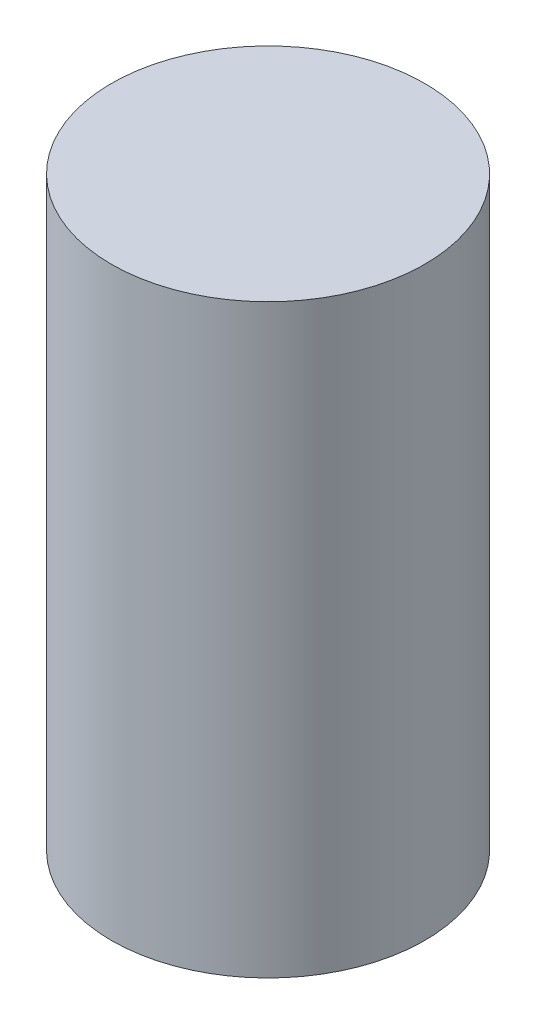
ISO-10303-21;
HEADER;
FILE_DESCRIPTION(('STEP AP214'),'2;1');
FILE_NAME('part.step','',(''),(''),'','','');
FILE_SCHEMA(('AUTOMOTIVE_DESIGN { 1 0 10303 214 1 1 1 1 }'));
ENDSEC;
DATA;
#1=APPLICATION_CONTEXT('core data for automotive mechanical design processes');
#2=APPLICATION_PROTOCOL_DEFINITION('international standard','automotive_design',2000,#1);
#3=PRODUCT_CONTEXT('',#1,'mechanical');
#4=PRODUCT('Part','Part','',(#3));
#5=PRODUCT_RELATED_PRODUCT_CATEGORY('part','',(#4));
#6=PRODUCT_DEFINITION_FORMATION('','',#4);
#7=PRODUCT_DEFINITION_CONTEXT('part definition',#1,'design');
#8=PRODUCT_DEFINITION('design','',#6,#7);
#9=PRODUCT_DEFINITION_SHAPE('','',#8);
#10=(LENGTH_UNIT() NAMED_UNIT(*) SI_UNIT(.MILLI.,.METRE.));
#11=(NAMED_UNIT(*) PLANE_ANGLE_UNIT() SI_UNIT($,.RADIAN.));
#12=(NAMED_UNIT(*) SI_UNIT($,.STERADIAN.) SOLID_ANGLE_UNIT());
#13=UNCERTAINTY_MEASURE_WITH_UNIT(LENGTH_MEASURE(1.E-05),#10,'distance_accuracy_value','');
#14=(GEOMETRIC_REPRESENTATION_CONTEXT(3) GLOBAL_UNCERTAINTY_ASSIGNED_CONTEXT((#13)) GLOBAL_UNIT_ASSIGNED_CONTEXT((#10,
#11,#12)) REPRESENTATION_CONTEXT('',''));
#15=CARTESIAN_POINT('',(0.,0.,0.));
#16=DIRECTION('',(0.,0.,1.));
#17=DIRECTION('',(1.,0.,0.));
#18=AXIS2_PLACEMENT_3D('',#15,#16,#17);
#19=CARTESIAN_POINT('',(0.,10.,0.));
#20=DIRECTION('',(0.,-1.,0.));
#21=DIRECTION('',(0.,0.,-1.));
#22=AXIS2_PLACEMENT_3D('',#19,#20,#21);
#23=CYLINDRICAL_SURFACE('',#22,2.675);
#24=CARTESIAN_POINT('',(0.,10.,0.));
#25=DIRECTION('',(0.,1.,0.));
#26=DIRECTION('',(0.,0.,1.));
#27=AXIS2_PLACEMENT_3D('',#24,#25,#26);
#28=CIRCLE('',#27,2.675);
#29=CARTESIAN_POINT('',(0.,10.,2.675));
#30=VERTEX_POINT('',#29);
#31=EDGE_CURVE('E10',#30,#30,#28,.T.);
#32=ORIENTED_EDGE('',*,*,#31,.F.);
#33=EDGE_LOOP('',(#32));
#34=FACE_BOUND('',#33,.T.);
#35=CARTESIAN_POINT('',(0.,0.,0.));
#36=DIRECTION('',(0.,1.,0.));
#37=DIRECTION('',(0.,0.,1.));
#38=AXIS2_PLACEMENT_3D('',#35,#36,#37);
#39=CIRCLE('',#38,2.675);
#40=CARTESIAN_POINT('',(0.,0.,2.675));
#41=VERTEX_POINT('',#40);
#42=EDGE_CURVE('E34',#41,#41,#39,.T.);
#43=ORIENTED_EDGE('',*,*,#42,.T.);
#44=EDGE_LOOP('',(#43));
#45=FACE_BOUND('',#44,.T.);
#46=ADVANCED_FACE('F31',(#34,#45),#23,.T.);
#47=CARTESIAN_POINT('',(0.,10.,0.));
#48=DIRECTION('',(0.,1.,0.));
#49=DIRECTION('',(0.,0.,1.));
#50=AXIS2_PLACEMENT_3D('',#47,#48,#49);
#51=PLANE('',#50);
#52=ORIENTED_EDGE('',*,*,#31,.T.);
#53=EDGE_LOOP('',(#52));
#54=FACE_BOUND('',#53,.T.);
#55=ADVANCED_FACE('F46',(#54),#51,.T.);
#56=CARTESIAN_POINT('',(0.,0.,0.));
#57=DIRECTION('',(0.,1.,0.));
#58=DIRECTION('',(0.,0.,1.));
#59=AXIS2_PLACEMENT_3D('',#56,#57,#58);
#60=PLANE('',#59);
#61=ORIENTED_EDGE('',*,*,#42,.F.);
#62=EDGE_LOOP('',(#61));
#63=FACE_BOUND('',#62,.T.);
#64=ADVANCED_FACE('F44',(#63),#60,.F.);
#65=CLOSED_SHELL('',(#46,#55,#64));
#66=MANIFOLD_SOLID_BREP('B2',#65);
#67=ADVANCED_BREP_SHAPE_REPRESENTATION('',(#18,#66),#14);
#68=SHAPE_DEFINITION_REPRESENTATION(#9,#67);
ENDSEC;
END-ISO-10303-21;
